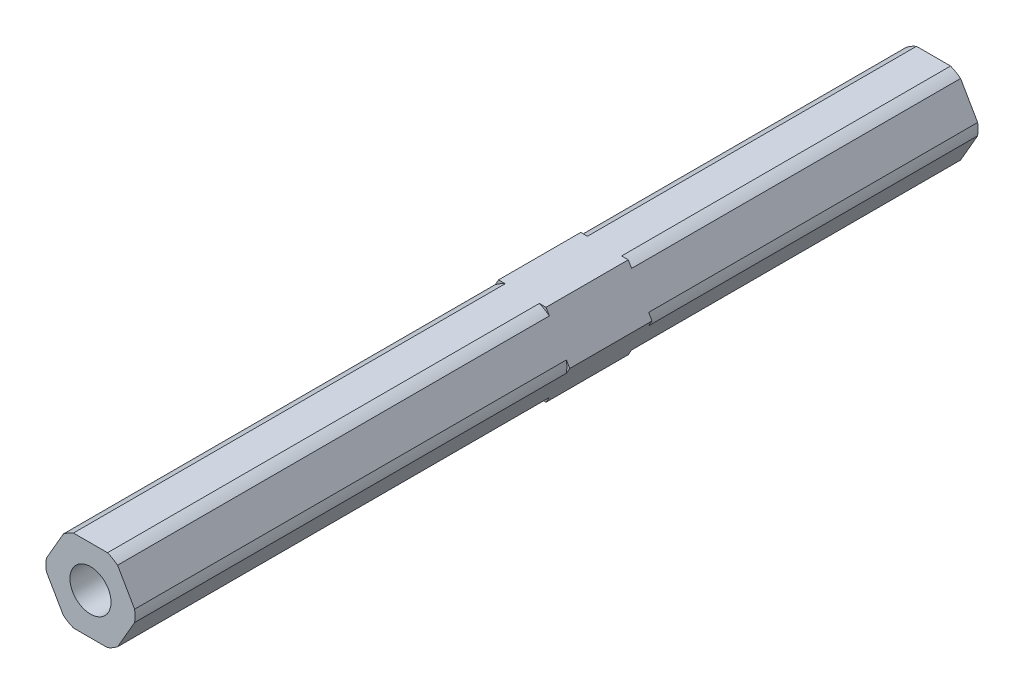
ISO-10303-21;
HEADER;
FILE_DESCRIPTION(('STEP AP214'),'2;1');
FILE_NAME('part.step','',(''),(''),'','','');
FILE_SCHEMA(('AUTOMOTIVE_DESIGN { 1 0 10303 214 1 1 1 1 }'));
ENDSEC;
DATA;
#1=APPLICATION_CONTEXT('core data for automotive mechanical design processes');
#2=APPLICATION_PROTOCOL_DEFINITION('international standard','automotive_design',2000,#1);
#3=PRODUCT_CONTEXT('',#1,'mechanical');
#4=PRODUCT('Part','Part','',(#3));
#5=PRODUCT_RELATED_PRODUCT_CATEGORY('part','',(#4));
#6=PRODUCT_DEFINITION_FORMATION('','',#4);
#7=PRODUCT_DEFINITION_CONTEXT('part definition',#1,'design');
#8=PRODUCT_DEFINITION('design','',#6,#7);
#9=PRODUCT_DEFINITION_SHAPE('','',#8);
#10=(LENGTH_UNIT() NAMED_UNIT(*) SI_UNIT(.MILLI.,.METRE.));
#11=(NAMED_UNIT(*) PLANE_ANGLE_UNIT() SI_UNIT($,.RADIAN.));
#12=(NAMED_UNIT(*) SI_UNIT($,.STERADIAN.) SOLID_ANGLE_UNIT());
#13=UNCERTAINTY_MEASURE_WITH_UNIT(LENGTH_MEASURE(1.E-05),#10,'distance_accuracy_value','');
#14=(GEOMETRIC_REPRESENTATION_CONTEXT(3) GLOBAL_UNCERTAINTY_ASSIGNED_CONTEXT((#13)) GLOBAL_UNIT_ASSIGNED_CONTEXT((#10,
#11,#12)) REPRESENTATION_CONTEXT('',''));
#15=CARTESIAN_POINT('',(0.,0.,0.));
#16=DIRECTION('',(0.,0.,1.));
#17=DIRECTION('',(1.,0.,0.));
#18=AXIS2_PLACEMENT_3D('',#15,#16,#17);
#19=CARTESIAN_POINT('',(0.,0.,0.));
#20=DIRECTION('',(0.,0.,1.));
#21=DIRECTION('',(1.,0.,0.));
#22=AXIS2_PLACEMENT_3D('',#19,#20,#21);
#23=PLANE('',#22);
#24=CARTESIAN_POINT('',(0.,0.,0.));
#25=DIRECTION('',(0.,0.,-1.));
#26=DIRECTION('',(-1.,0.,0.));
#27=AXIS2_PLACEMENT_3D('',#24,#25,#26);
#28=CIRCLE('',#27,6.875);
#29=CARTESIAN_POINT('',(-4.18177080173138,5.45696050579321,0.));
#30=VERTEX_POINT('',#29);
#31=CARTESIAN_POINT('',(-2.63498102459961,6.35,0.));
#32=VERTEX_POINT('',#31);
#33=EDGE_CURVE('E248',#30,#32,#28,.T.);
#34=ORIENTED_EDGE('',*,*,#33,.F.);
#35=DIRECTION('',(-0.5,-0.866025403784439,0.));
#36=VECTOR('',#35,1.);
#37=CARTESIAN_POINT('',(-3.66617420935412,6.35,0.));
#38=LINE('',#37,#36);
#39=CARTESIAN_POINT('',(-3.66617420935412,6.35,0.));
#40=VERTEX_POINT('',#39);
#41=EDGE_CURVE('E440',#40,#30,#38,.T.);
#42=ORIENTED_EDGE('',*,*,#41,.F.);
#43=DIRECTION('',(-1.,0.,0.));
#44=VECTOR('',#43,1.);
#45=CARTESIAN_POINT('',(3.66617420935412,6.35,0.));
#46=LINE('',#45,#44);
#47=EDGE_CURVE('E436',#32,#40,#46,.T.);
#48=ORIENTED_EDGE('',*,*,#47,.F.);
#49=EDGE_LOOP('',(#34,#42,#48));
#50=FACE_BOUND('',#49,.T.);
#51=ADVANCED_FACE('F35',(#50),#23,.F.);
#52=CARTESIAN_POINT('',(0.,0.,0.));
#53=DIRECTION('',(0.,0.,-1.));
#54=DIRECTION('',(-1.,0.,0.));
#55=AXIS2_PLACEMENT_3D('',#52,#53,#54);
#56=CIRCLE('',#55,6.875);
#57=CARTESIAN_POINT('',(-6.81675182633099,-0.89303949420679,0.));
#58=VERTEX_POINT('',#57);
#59=CARTESIAN_POINT('',(-6.81675182633099,0.893039494206787,0.));
#60=VERTEX_POINT('',#59);
#61=EDGE_CURVE('E290',#58,#60,#56,.T.);
#62=ORIENTED_EDGE('',*,*,#61,.F.);
#63=DIRECTION('',(0.5,-0.866025403784439,0.));
#64=VECTOR('',#63,1.);
#65=CARTESIAN_POINT('',(-7.33234841870825,0.,0.));
#66=LINE('',#65,#64);
#67=CARTESIAN_POINT('',(-7.33234841870825,0.,0.));
#68=VERTEX_POINT('',#67);
#69=EDGE_CURVE('E444',#68,#58,#66,.T.);
#70=ORIENTED_EDGE('',*,*,#69,.F.);
#71=EDGE_CURVE('E439',#60,#68,#38,.T.);
#72=ORIENTED_EDGE('',*,*,#71,.F.);
#73=EDGE_LOOP('',(#62,#70,#72));
#74=FACE_BOUND('',#73,.T.);
#75=ADVANCED_FACE('F565',(#74),#23,.F.);
#76=CARTESIAN_POINT('',(0.,0.,0.));
#77=DIRECTION('',(0.,0.,-1.));
#78=DIRECTION('',(-1.,0.,0.));
#79=AXIS2_PLACEMENT_3D('',#76,#77,#78);
#80=CIRCLE('',#79,6.875);
#81=CARTESIAN_POINT('',(-2.63498102459961,-6.35,0.));
#82=VERTEX_POINT('',#81);
#83=CARTESIAN_POINT('',(-4.18177080173138,-5.45696050579321,0.));
#84=VERTEX_POINT('',#83);
#85=EDGE_CURVE('E294',#82,#84,#80,.T.);
#86=ORIENTED_EDGE('',*,*,#85,.F.);
#87=DIRECTION('',(1.,0.,0.));
#88=VECTOR('',#87,1.);
#89=CARTESIAN_POINT('',(-3.66617420935412,-6.35,0.));
#90=LINE('',#89,#88);
#91=CARTESIAN_POINT('',(-3.66617420935412,-6.35,0.));
#92=VERTEX_POINT('',#91);
#93=EDGE_CURVE('E427',#92,#82,#90,.T.);
#94=ORIENTED_EDGE('',*,*,#93,.F.);
#95=EDGE_CURVE('E443',#84,#92,#66,.T.);
#96=ORIENTED_EDGE('',*,*,#95,.F.);
#97=EDGE_LOOP('',(#86,#94,#96));
#98=FACE_BOUND('',#97,.T.);
#99=ADVANCED_FACE('F562',(#98),#23,.F.);
#100=CARTESIAN_POINT('',(0.,0.,0.));
#101=DIRECTION('',(0.,0.,-1.));
#102=DIRECTION('',(-1.,0.,0.));
#103=AXIS2_PLACEMENT_3D('',#100,#101,#102);
#104=CIRCLE('',#103,6.875);
#105=CARTESIAN_POINT('',(4.18177080173138,-5.45696050579321,0.));
#106=VERTEX_POINT('',#105);
#107=CARTESIAN_POINT('',(2.63498102459961,-6.35,0.));
#108=VERTEX_POINT('',#107);
#109=EDGE_CURVE('E58',#106,#108,#104,.T.);
#110=ORIENTED_EDGE('',*,*,#109,.F.);
#111=DIRECTION('',(0.5,0.866025403784439,0.));
#112=VECTOR('',#111,1.);
#113=CARTESIAN_POINT('',(3.66617420935412,-6.35,0.));
#114=LINE('',#113,#112);
#115=CARTESIAN_POINT('',(3.66617420935412,-6.35,0.));
#116=VERTEX_POINT('',#115);
#117=EDGE_CURVE('E430',#116,#106,#114,.T.);
#118=ORIENTED_EDGE('',*,*,#117,.F.);
#119=EDGE_CURVE('E407',#108,#116,#90,.T.);
#120=ORIENTED_EDGE('',*,*,#119,.F.);
#121=EDGE_LOOP('',(#110,#118,#120));
#122=FACE_BOUND('',#121,.T.);
#123=ADVANCED_FACE('F564',(#122),#23,.F.);
#124=CARTESIAN_POINT('',(0.,0.,0.));
#125=DIRECTION('',(0.,0.,-1.));
#126=DIRECTION('',(-1.,0.,0.));
#127=AXIS2_PLACEMENT_3D('',#124,#125,#126);
#128=CIRCLE('',#127,6.875);
#129=CARTESIAN_POINT('',(6.81675182633099,0.893039494206791,0.));
#130=VERTEX_POINT('',#129);
#131=CARTESIAN_POINT('',(6.81675182633099,-0.893039494206787,0.));
#132=VERTEX_POINT('',#131);
#133=EDGE_CURVE('E261',#130,#132,#128,.T.);
#134=ORIENTED_EDGE('',*,*,#133,.F.);
#135=DIRECTION('',(-0.5,0.866025403784439,0.));
#136=VECTOR('',#135,1.);
#137=CARTESIAN_POINT('',(7.33234841870825,0.,0.));
#138=LINE('',#137,#136);
#139=CARTESIAN_POINT('',(7.33234841870825,0.,0.));
#140=VERTEX_POINT('',#139);
#141=EDGE_CURVE('E433',#140,#130,#138,.T.);
#142=ORIENTED_EDGE('',*,*,#141,.F.);
#143=EDGE_CURVE('E50',#132,#140,#114,.T.);
#144=ORIENTED_EDGE('',*,*,#143,.F.);
#145=EDGE_LOOP('',(#134,#142,#144));
#146=FACE_BOUND('',#145,.T.);
#147=ADVANCED_FACE('F464',(#146),#23,.F.);
#148=CARTESIAN_POINT('',(0.,0.,12.7));
#149=DIRECTION('',(0.,0.,1.));
#150=DIRECTION('',(1.,0.,0.));
#151=AXIS2_PLACEMENT_3D('',#148,#149,#150);
#152=PLANE('',#151);
#153=CARTESIAN_POINT('',(0.,0.,12.7));
#154=DIRECTION('',(0.,0.,1.));
#155=DIRECTION('',(1.,0.,0.));
#156=AXIS2_PLACEMENT_3D('',#153,#154,#155);
#157=CIRCLE('',#156,6.875);
#158=CARTESIAN_POINT('',(-2.63498102459961,6.35,12.7));
#159=VERTEX_POINT('',#158);
#160=CARTESIAN_POINT('',(-4.18177080173138,5.45696050579321,12.7));
#161=VERTEX_POINT('',#160);
#162=EDGE_CURVE('E301',#159,#161,#157,.T.);
#163=ORIENTED_EDGE('',*,*,#162,.F.);
#164=DIRECTION('',(-1.,0.,0.));
#165=VECTOR('',#164,1.);
#166=CARTESIAN_POINT('',(3.66617420935412,6.35,12.7));
#167=LINE('',#166,#165);
#168=CARTESIAN_POINT('',(-3.66617420935412,6.35,12.7));
#169=VERTEX_POINT('',#168);
#170=EDGE_CURVE('E417',#159,#169,#167,.T.);
#171=ORIENTED_EDGE('',*,*,#170,.T.);
#172=DIRECTION('',(-0.5,-0.866025403784439,0.));
#173=VECTOR('',#172,1.);
#174=CARTESIAN_POINT('',(-3.66617420935412,6.35,12.7));
#175=LINE('',#174,#173);
#176=EDGE_CURVE('E421',#169,#161,#175,.T.);
#177=ORIENTED_EDGE('',*,*,#176,.T.);
#178=EDGE_LOOP('',(#163,#171,#177));
#179=FACE_BOUND('',#178,.T.);
#180=ADVANCED_FACE('F538',(#179),#152,.T.);
#181=CARTESIAN_POINT('',(0.,0.,12.7));
#182=DIRECTION('',(0.,0.,1.));
#183=DIRECTION('',(1.,0.,0.));
#184=AXIS2_PLACEMENT_3D('',#181,#182,#183);
#185=CIRCLE('',#184,6.875);
#186=CARTESIAN_POINT('',(4.18177080173138,5.45696050579321,12.7));
#187=VERTEX_POINT('',#186);
#188=CARTESIAN_POINT('',(2.63498102459961,6.35,12.7));
#189=VERTEX_POINT('',#188);
#190=EDGE_CURVE('E333',#187,#189,#185,.T.);
#191=ORIENTED_EDGE('',*,*,#190,.F.);
#192=DIRECTION('',(-0.5,0.866025403784439,0.));
#193=VECTOR('',#192,1.);
#194=CARTESIAN_POINT('',(7.33234841870825,0.,12.7));
#195=LINE('',#194,#193);
#196=CARTESIAN_POINT('',(3.66617420935412,6.35,12.7));
#197=VERTEX_POINT('',#196);
#198=EDGE_CURVE('E414',#187,#197,#195,.T.);
#199=ORIENTED_EDGE('',*,*,#198,.T.);
#200=EDGE_CURVE('E418',#197,#189,#167,.T.);
#201=ORIENTED_EDGE('',*,*,#200,.T.);
#202=EDGE_LOOP('',(#191,#199,#201));
#203=FACE_BOUND('',#202,.T.);
#204=ADVANCED_FACE('F589',(#203),#152,.T.);
#205=CARTESIAN_POINT('',(0.,0.,12.7));
#206=DIRECTION('',(0.,0.,1.));
#207=DIRECTION('',(1.,0.,0.));
#208=AXIS2_PLACEMENT_3D('',#205,#206,#207);
#209=CIRCLE('',#208,6.875);
#210=CARTESIAN_POINT('',(6.81675182633099,-0.893039494206791,12.7));
#211=VERTEX_POINT('',#210);
#212=CARTESIAN_POINT('',(6.81675182633099,0.893039494206794,12.7));
#213=VERTEX_POINT('',#212);
#214=EDGE_CURVE('E367',#211,#213,#209,.T.);
#215=ORIENTED_EDGE('',*,*,#214,.F.);
#216=DIRECTION('',(0.5,0.866025403784439,0.));
#217=VECTOR('',#216,1.);
#218=CARTESIAN_POINT('',(3.66617420935412,-6.35,12.7));
#219=LINE('',#218,#217);
#220=CARTESIAN_POINT('',(7.33234841870825,0.,12.7));
#221=VERTEX_POINT('',#220);
#222=EDGE_CURVE('E410',#211,#221,#219,.T.);
#223=ORIENTED_EDGE('',*,*,#222,.T.);
#224=EDGE_CURVE('E415',#221,#213,#195,.T.);
#225=ORIENTED_EDGE('',*,*,#224,.T.);
#226=EDGE_LOOP('',(#215,#223,#225));
#227=FACE_BOUND('',#226,.T.);
#228=ADVANCED_FACE('F497',(#227),#152,.T.);
#229=CARTESIAN_POINT('',(0.,0.,12.7));
#230=DIRECTION('',(0.,0.,1.));
#231=DIRECTION('',(1.,0.,0.));
#232=AXIS2_PLACEMENT_3D('',#229,#230,#231);
#233=CIRCLE('',#232,6.875);
#234=CARTESIAN_POINT('',(2.63498102459961,-6.35,12.7));
#235=VERTEX_POINT('',#234);
#236=CARTESIAN_POINT('',(4.18177080173138,-5.45696050579321,12.7));
#237=VERTEX_POINT('',#236);
#238=EDGE_CURVE('E364',#235,#237,#233,.T.);
#239=ORIENTED_EDGE('',*,*,#238,.F.);
#240=DIRECTION('',(1.,0.,0.));
#241=VECTOR('',#240,1.);
#242=CARTESIAN_POINT('',(-3.66617420935412,-6.35,12.7));
#243=LINE('',#242,#241);
#244=CARTESIAN_POINT('',(3.66617420935412,-6.35,12.7));
#245=VERTEX_POINT('',#244);
#246=EDGE_CURVE('E411',#235,#245,#243,.T.);
#247=ORIENTED_EDGE('',*,*,#246,.T.);
#248=EDGE_CURVE('E412',#245,#237,#219,.T.);
#249=ORIENTED_EDGE('',*,*,#248,.T.);
#250=EDGE_LOOP('',(#239,#247,#249));
#251=FACE_BOUND('',#250,.T.);
#252=ADVANCED_FACE('F509',(#251),#152,.T.);
#253=CARTESIAN_POINT('',(0.,0.,12.7));
#254=DIRECTION('',(0.,0.,1.));
#255=DIRECTION('',(1.,0.,0.));
#256=AXIS2_PLACEMENT_3D('',#253,#254,#255);
#257=CIRCLE('',#256,6.875);
#258=CARTESIAN_POINT('',(-4.18177080173138,-5.45696050579321,12.7));
#259=VERTEX_POINT('',#258);
#260=CARTESIAN_POINT('',(-2.6349810245996,-6.35,12.7));
#261=VERTEX_POINT('',#260);
#262=EDGE_CURVE('E361',#259,#261,#257,.T.);
#263=ORIENTED_EDGE('',*,*,#262,.F.);
#264=DIRECTION('',(0.5,-0.866025403784439,0.));
#265=VECTOR('',#264,1.);
#266=CARTESIAN_POINT('',(-7.33234841870825,0.,12.7));
#267=LINE('',#266,#265);
#268=CARTESIAN_POINT('',(-3.66617420935412,-6.35,12.7));
#269=VERTEX_POINT('',#268);
#270=EDGE_CURVE('E423',#259,#269,#267,.T.);
#271=ORIENTED_EDGE('',*,*,#270,.T.);
#272=EDGE_CURVE('E408',#269,#261,#243,.T.);
#273=ORIENTED_EDGE('',*,*,#272,.T.);
#274=EDGE_LOOP('',(#263,#271,#273));
#275=FACE_BOUND('',#274,.T.);
#276=ADVANCED_FACE('F560',(#275),#152,.T.);
#277=CARTESIAN_POINT('',(-3.66617420935412,-6.35,12.7));
#278=DIRECTION('',(0.,1.,0.));
#279=DIRECTION('',(-1.,0.,0.));
#280=AXIS2_PLACEMENT_3D('',#277,#278,#279);
#281=PLANE('',#280);
#282=ORIENTED_EDGE('',*,*,#93,.T.);
#283=DIRECTION('',(0.,0.,1.));
#284=VECTOR('',#283,1.);
#285=CARTESIAN_POINT('',(-2.63498102459961,-6.35,-50.8));
#286=LINE('',#285,#284);
#287=CARTESIAN_POINT('',(-2.63498102459961,-6.35,-50.8));
#288=VERTEX_POINT('',#287);
#289=EDGE_CURVE('E316',#288,#82,#286,.T.);
#290=ORIENTED_EDGE('',*,*,#289,.F.);
#291=DIRECTION('',(1.,0.,0.));
#292=VECTOR('',#291,1.);
#293=CARTESIAN_POINT('',(-2.63498102459961,-6.35,-50.8));
#294=LINE('',#293,#292);
#295=CARTESIAN_POINT('',(2.63498102459962,-6.35,-50.8));
#296=VERTEX_POINT('',#295);
#297=EDGE_CURVE('E275',#288,#296,#294,.T.);
#298=ORIENTED_EDGE('',*,*,#297,.T.);
#299=DIRECTION('',(0.,0.,1.));
#300=VECTOR('',#299,1.);
#301=CARTESIAN_POINT('',(2.63498102459962,-6.35,-50.8));
#302=LINE('',#301,#300);
#303=EDGE_CURVE('E313',#296,#108,#302,.T.);
#304=ORIENTED_EDGE('',*,*,#303,.T.);
#305=ORIENTED_EDGE('',*,*,#119,.T.);
#306=DIRECTION('',(0.,0.,-1.));
#307=VECTOR('',#306,1.);
#308=CARTESIAN_POINT('',(3.66617420935412,-6.35,12.7));
#309=LINE('',#308,#307);
#310=EDGE_CURVE('E11',#245,#116,#309,.T.);
#311=ORIENTED_EDGE('',*,*,#310,.F.);
#312=ORIENTED_EDGE('',*,*,#246,.F.);
#313=DIRECTION('',(0.,0.,-1.));
#314=VECTOR('',#313,1.);
#315=CARTESIAN_POINT('',(2.63498102459961,-6.35,79.375));
#316=LINE('',#315,#314);
#317=CARTESIAN_POINT('',(2.63498102459961,-6.35,79.375));
#318=VERTEX_POINT('',#317);
#319=EDGE_CURVE('E389',#318,#235,#316,.T.);
#320=ORIENTED_EDGE('',*,*,#319,.F.);
#321=DIRECTION('',(1.,0.,0.));
#322=VECTOR('',#321,1.);
#323=CARTESIAN_POINT('',(-2.6349810245996,-6.35,79.375));
#324=LINE('',#323,#322);
#325=CARTESIAN_POINT('',(-2.6349810245996,-6.35,79.375));
#326=VERTEX_POINT('',#325);
#327=EDGE_CURVE('E341',#326,#318,#324,.T.);
#328=ORIENTED_EDGE('',*,*,#327,.F.);
#329=DIRECTION('',(0.,0.,-1.));
#330=VECTOR('',#329,1.);
#331=CARTESIAN_POINT('',(-2.6349810245996,-6.35,79.375));
#332=LINE('',#331,#330);
#333=EDGE_CURVE('E392',#326,#261,#332,.T.);
#334=ORIENTED_EDGE('',*,*,#333,.T.);
#335=ORIENTED_EDGE('',*,*,#272,.F.);
#336=DIRECTION('',(0.,0.,-1.));
#337=VECTOR('',#336,1.);
#338=CARTESIAN_POINT('',(-3.66617420935412,-6.35,12.7));
#339=LINE('',#338,#337);
#340=EDGE_CURVE('E426',#269,#92,#339,.T.);
#341=ORIENTED_EDGE('',*,*,#340,.T.);
#342=EDGE_LOOP('',(#282,#290,#298,#304,#305,#311,#312,#320,#328,#334,#335,#341));
#343=FACE_BOUND('',#342,.T.);
#344=ADVANCED_FACE('F37',(#343),#281,.F.);
#345=CARTESIAN_POINT('',(3.66617420935412,-6.35,12.7));
#346=DIRECTION('',(-0.866025403784439,0.5,0.));
#347=DIRECTION('',(-0.5,-0.866025403784439,0.));
#348=AXIS2_PLACEMENT_3D('',#345,#346,#347);
#349=PLANE('',#348);
#350=ORIENTED_EDGE('',*,*,#117,.T.);
#351=DIRECTION('',(0.,0.,1.));
#352=VECTOR('',#351,1.);
#353=CARTESIAN_POINT('',(4.18177080173138,-5.45696050579321,-50.8));
#354=LINE('',#353,#352);
#355=CARTESIAN_POINT('',(4.18177080173138,-5.45696050579321,-50.8));
#356=VERTEX_POINT('',#355);
#357=EDGE_CURVE('E310',#356,#106,#354,.T.);
#358=ORIENTED_EDGE('',*,*,#357,.F.);
#359=DIRECTION('',(0.5,0.866025403784439,0.));
#360=VECTOR('',#359,1.);
#361=CARTESIAN_POINT('',(4.18177080173138,-5.45696050579321,-50.8));
#362=LINE('',#361,#360);
#363=CARTESIAN_POINT('',(6.81675182633099,-0.893039494206785,-50.8));
#364=VERTEX_POINT('',#363);
#365=EDGE_CURVE('E280',#356,#364,#362,.T.);
#366=ORIENTED_EDGE('',*,*,#365,.T.);
#367=DIRECTION('',(0.,0.,1.));
#368=VECTOR('',#367,1.);
#369=CARTESIAN_POINT('',(6.81675182633099,-0.893039494206785,-50.8));
#370=LINE('',#369,#368);
#371=EDGE_CURVE('E308',#364,#132,#370,.T.);
#372=ORIENTED_EDGE('',*,*,#371,.T.);
#373=ORIENTED_EDGE('',*,*,#143,.T.);
#374=DIRECTION('',(0.,0.,-1.));
#375=VECTOR('',#374,1.);
#376=CARTESIAN_POINT('',(7.33234841870825,0.,12.7));
#377=LINE('',#376,#375);
#378=EDGE_CURVE('E43',#221,#140,#377,.T.);
#379=ORIENTED_EDGE('',*,*,#378,.F.);
#380=ORIENTED_EDGE('',*,*,#222,.F.);
#381=DIRECTION('',(0.,0.,-1.));
#382=VECTOR('',#381,1.);
#383=CARTESIAN_POINT('',(6.81675182633099,-0.893039494206794,79.375));
#384=LINE('',#383,#382);
#385=CARTESIAN_POINT('',(6.81675182633099,-0.893039494206794,79.375));
#386=VERTEX_POINT('',#385);
#387=EDGE_CURVE('E383',#386,#211,#384,.T.);
#388=ORIENTED_EDGE('',*,*,#387,.F.);
#389=DIRECTION('',(0.5,0.866025403784438,0.));
#390=VECTOR('',#389,1.);
#391=CARTESIAN_POINT('',(4.18177080173138,-5.45696050579321,79.375));
#392=LINE('',#391,#390);
#393=CARTESIAN_POINT('',(4.18177080173138,-5.45696050579321,79.375));
#394=VERTEX_POINT('',#393);
#395=EDGE_CURVE('E345',#394,#386,#392,.T.);
#396=ORIENTED_EDGE('',*,*,#395,.F.);
#397=DIRECTION('',(0.,0.,-1.));
#398=VECTOR('',#397,1.);
#399=CARTESIAN_POINT('',(4.18177080173138,-5.45696050579321,79.375));
#400=LINE('',#399,#398);
#401=EDGE_CURVE('E386',#394,#237,#400,.T.);
#402=ORIENTED_EDGE('',*,*,#401,.T.);
#403=ORIENTED_EDGE('',*,*,#248,.F.);
#404=ORIENTED_EDGE('',*,*,#310,.T.);
#405=EDGE_LOOP('',(#350,#358,#366,#372,#373,#379,#380,#388,#396,#402,#403,#404));
#406=FACE_BOUND('',#405,.T.);
#407=ADVANCED_FACE('F498',(#406),#349,.F.);
#408=CARTESIAN_POINT('',(7.33234841870825,0.,12.7));
#409=DIRECTION('',(-0.866025403784439,-0.5,0.));
#410=DIRECTION('',(0.5,-0.866025403784439,0.));
#411=AXIS2_PLACEMENT_3D('',#408,#409,#410);
#412=PLANE('',#411);
#413=ORIENTED_EDGE('',*,*,#141,.T.);
#414=DIRECTION('',(0.,0.,1.));
#415=VECTOR('',#414,1.);
#416=CARTESIAN_POINT('',(6.81675182633099,0.893039494206793,-50.8));
#417=LINE('',#416,#415);
#418=CARTESIAN_POINT('',(6.81675182633099,0.893039494206793,-50.8));
#419=VERTEX_POINT('',#418);
#420=EDGE_CURVE('E305',#419,#130,#417,.T.);
#421=ORIENTED_EDGE('',*,*,#420,.F.);
#422=DIRECTION('',(-0.5,0.866025403784439,0.));
#423=VECTOR('',#422,1.);
#424=CARTESIAN_POINT('',(6.81675182633099,0.893039494206793,-50.8));
#425=LINE('',#424,#423);
#426=CARTESIAN_POINT('',(4.18177080173138,5.45696050579321,-50.8));
#427=VERTEX_POINT('',#426);
#428=EDGE_CURVE('E285',#419,#427,#425,.T.);
#429=ORIENTED_EDGE('',*,*,#428,.T.);
#430=DIRECTION('',(0.,0.,1.));
#431=VECTOR('',#430,1.);
#432=CARTESIAN_POINT('',(4.18177080173138,5.45696050579321,-50.8));
#433=LINE('',#432,#431);
#434=CARTESIAN_POINT('',(4.18177080173138,5.45696050579321,0.));
#435=VERTEX_POINT('',#434);
#436=EDGE_CURVE('E302',#427,#435,#433,.T.);
#437=ORIENTED_EDGE('',*,*,#436,.T.);
#438=CARTESIAN_POINT('',(3.66617420935412,6.35,0.));
#439=VERTEX_POINT('',#438);
#440=EDGE_CURVE('E432',#435,#439,#138,.T.);
#441=ORIENTED_EDGE('',*,*,#440,.T.);
#442=DIRECTION('',(0.,0.,-1.));
#443=VECTOR('',#442,1.);
#444=CARTESIAN_POINT('',(3.66617420935412,6.35,12.7));
#445=LINE('',#444,#443);
#446=EDGE_CURVE('E455',#197,#439,#445,.T.);
#447=ORIENTED_EDGE('',*,*,#446,.F.);
#448=ORIENTED_EDGE('',*,*,#198,.F.);
#449=DIRECTION('',(0.,0.,-1.));
#450=VECTOR('',#449,1.);
#451=CARTESIAN_POINT('',(4.18177080173138,5.45696050579321,79.375));
#452=LINE('',#451,#450);
#453=CARTESIAN_POINT('',(4.18177080173138,5.45696050579321,79.375));
#454=VERTEX_POINT('',#453);
#455=EDGE_CURVE('E377',#454,#187,#452,.T.);
#456=ORIENTED_EDGE('',*,*,#455,.F.);
#457=DIRECTION('',(-0.5,0.866025403784439,0.));
#458=VECTOR('',#457,1.);
#459=CARTESIAN_POINT('',(6.81675182633099,0.893039494206794,79.375));
#460=LINE('',#459,#458);
#461=CARTESIAN_POINT('',(6.81675182633099,0.893039494206794,79.375));
#462=VERTEX_POINT('',#461);
#463=EDGE_CURVE('E349',#462,#454,#460,.T.);
#464=ORIENTED_EDGE('',*,*,#463,.F.);
#465=DIRECTION('',(0.,0.,-1.));
#466=VECTOR('',#465,1.);
#467=CARTESIAN_POINT('',(6.81675182633099,0.893039494206794,79.375));
#468=LINE('',#467,#466);
#469=EDGE_CURVE('E380',#462,#213,#468,.T.);
#470=ORIENTED_EDGE('',*,*,#469,.T.);
#471=ORIENTED_EDGE('',*,*,#224,.F.);
#472=ORIENTED_EDGE('',*,*,#378,.T.);
#473=EDGE_LOOP('',(#413,#421,#429,#437,#441,#447,#448,#456,#464,#470,#471,#472));
#474=FACE_BOUND('',#473,.T.);
#475=ADVANCED_FACE('F461',(#474),#412,.F.);
#476=CARTESIAN_POINT('',(3.66617420935412,6.35,12.7));
#477=DIRECTION('',(0.,-1.,0.));
#478=DIRECTION('',(1.,0.,0.));
#479=AXIS2_PLACEMENT_3D('',#476,#477,#478);
#480=PLANE('',#479);
#481=CARTESIAN_POINT('',(2.63498102459961,6.35,0.));
#482=VERTEX_POINT('',#481);
#483=EDGE_CURVE('E437',#439,#482,#46,.T.);
#484=ORIENTED_EDGE('',*,*,#483,.T.);
#485=DIRECTION('',(0.,0.,1.));
#486=VECTOR('',#485,1.);
#487=CARTESIAN_POINT('',(2.63498102459961,6.35,-50.8));
#488=LINE('',#487,#486);
#489=CARTESIAN_POINT('',(2.63498102459961,6.35,-50.8));
#490=VERTEX_POINT('',#489);
#491=EDGE_CURVE('E256',#490,#482,#488,.T.);
#492=ORIENTED_EDGE('',*,*,#491,.F.);
#493=DIRECTION('',(-1.,0.,0.));
#494=VECTOR('',#493,1.);
#495=CARTESIAN_POINT('',(2.63498102459961,6.35,-50.8));
#496=LINE('',#495,#494);
#497=CARTESIAN_POINT('',(-2.63498102459961,6.35,-50.8));
#498=VERTEX_POINT('',#497);
#499=EDGE_CURVE('E238',#490,#498,#496,.T.);
#500=ORIENTED_EDGE('',*,*,#499,.T.);
#501=DIRECTION('',(0.,0.,1.));
#502=VECTOR('',#501,1.);
#503=CARTESIAN_POINT('',(-2.63498102459961,6.35,-50.8));
#504=LINE('',#503,#502);
#505=EDGE_CURVE('E246',#498,#32,#504,.T.);
#506=ORIENTED_EDGE('',*,*,#505,.T.);
#507=ORIENTED_EDGE('',*,*,#47,.T.);
#508=DIRECTION('',(0.,0.,-1.));
#509=VECTOR('',#508,1.);
#510=CARTESIAN_POINT('',(-3.66617420935412,6.35,12.7));
#511=LINE('',#510,#509);
#512=EDGE_CURVE('E452',#169,#40,#511,.T.);
#513=ORIENTED_EDGE('',*,*,#512,.F.);
#514=ORIENTED_EDGE('',*,*,#170,.F.);
#515=DIRECTION('',(0.,0.,-1.));
#516=VECTOR('',#515,1.);
#517=CARTESIAN_POINT('',(-2.63498102459961,6.35,79.375));
#518=LINE('',#517,#516);
#519=CARTESIAN_POINT('',(-2.63498102459961,6.35,79.375));
#520=VERTEX_POINT('',#519);
#521=EDGE_CURVE('E355',#520,#159,#518,.T.);
#522=ORIENTED_EDGE('',*,*,#521,.F.);
#523=DIRECTION('',(-1.,0.,0.));
#524=VECTOR('',#523,1.);
#525=CARTESIAN_POINT('',(2.63498102459961,6.35,79.375));
#526=LINE('',#525,#524);
#527=CARTESIAN_POINT('',(2.63498102459961,6.35,79.375));
#528=VERTEX_POINT('',#527);
#529=EDGE_CURVE('E353',#528,#520,#526,.T.);
#530=ORIENTED_EDGE('',*,*,#529,.F.);
#531=DIRECTION('',(0.,0.,-1.));
#532=VECTOR('',#531,1.);
#533=CARTESIAN_POINT('',(2.63498102459961,6.35,79.375));
#534=LINE('',#533,#532);
#535=EDGE_CURVE('E374',#528,#189,#534,.T.);
#536=ORIENTED_EDGE('',*,*,#535,.T.);
#537=ORIENTED_EDGE('',*,*,#200,.F.);
#538=ORIENTED_EDGE('',*,*,#446,.T.);
#539=EDGE_LOOP('',(#484,#492,#500,#506,#507,#513,#514,#522,#530,#536,#537,#538));
#540=FACE_BOUND('',#539,.T.);
#541=ADVANCED_FACE('F254',(#540),#480,.F.);
#542=CARTESIAN_POINT('',(-3.66617420935412,6.35,12.7));
#543=DIRECTION('',(0.866025403784439,-0.5,0.));
#544=DIRECTION('',(0.5,0.866025403784439,0.));
#545=AXIS2_PLACEMENT_3D('',#542,#543,#544);
#546=PLANE('',#545);
#547=ORIENTED_EDGE('',*,*,#41,.T.);
#548=DIRECTION('',(0.,0.,1.));
#549=VECTOR('',#548,1.);
#550=CARTESIAN_POINT('',(-4.18177080173138,5.45696050579321,-50.8));
#551=LINE('',#550,#549);
#552=CARTESIAN_POINT('',(-4.18177080173138,5.45696050579321,-50.8));
#553=VERTEX_POINT('',#552);
#554=EDGE_CURVE('E250',#553,#30,#551,.T.);
#555=ORIENTED_EDGE('',*,*,#554,.F.);
#556=DIRECTION('',(-0.5,-0.866025403784439,0.));
#557=VECTOR('',#556,1.);
#558=CARTESIAN_POINT('',(-4.18177080173138,5.45696050579321,-50.8));
#559=LINE('',#558,#557);
#560=CARTESIAN_POINT('',(-6.81675182633099,0.89303949420678,-50.8));
#561=VERTEX_POINT('',#560);
#562=EDGE_CURVE('E240',#553,#561,#559,.T.);
#563=ORIENTED_EDGE('',*,*,#562,.T.);
#564=DIRECTION('',(0.,0.,1.));
#565=VECTOR('',#564,1.);
#566=CARTESIAN_POINT('',(-6.81675182633099,0.89303949420678,-50.8));
#567=LINE('',#566,#565);
#568=EDGE_CURVE('E325',#561,#60,#567,.T.);
#569=ORIENTED_EDGE('',*,*,#568,.T.);
#570=ORIENTED_EDGE('',*,*,#71,.T.);
#571=DIRECTION('',(0.,0.,-1.));
#572=VECTOR('',#571,1.);
#573=CARTESIAN_POINT('',(-7.33234841870825,0.,12.7));
#574=LINE('',#573,#572);
#575=CARTESIAN_POINT('',(-7.33234841870825,0.,12.7));
#576=VERTEX_POINT('',#575);
#577=EDGE_CURVE('E449',#576,#68,#574,.T.);
#578=ORIENTED_EDGE('',*,*,#577,.F.);
#579=CARTESIAN_POINT('',(-6.81675182633099,0.893039494206788,12.7));
#580=VERTEX_POINT('',#579);
#581=EDGE_CURVE('E420',#580,#576,#175,.T.);
#582=ORIENTED_EDGE('',*,*,#581,.F.);
#583=DIRECTION('',(0.,0.,-1.));
#584=VECTOR('',#583,1.);
#585=CARTESIAN_POINT('',(-6.81675182633099,0.893039494206787,79.375));
#586=LINE('',#585,#584);
#587=CARTESIAN_POINT('',(-6.81675182633099,0.893039494206787,79.375));
#588=VERTEX_POINT('',#587);
#589=EDGE_CURVE('E401',#588,#580,#586,.T.);
#590=ORIENTED_EDGE('',*,*,#589,.F.);
#591=DIRECTION('',(-0.5,-0.866025403784439,0.));
#592=VECTOR('',#591,1.);
#593=CARTESIAN_POINT('',(-4.18177080173138,5.45696050579321,79.375));
#594=LINE('',#593,#592);
#595=CARTESIAN_POINT('',(-4.18177080173138,5.45696050579321,79.375));
#596=VERTEX_POINT('',#595);
#597=EDGE_CURVE('E332',#596,#588,#594,.T.);
#598=ORIENTED_EDGE('',*,*,#597,.F.);
#599=DIRECTION('',(0.,0.,-1.));
#600=VECTOR('',#599,1.);
#601=CARTESIAN_POINT('',(-4.18177080173138,5.45696050579321,79.375));
#602=LINE('',#601,#600);
#603=EDGE_CURVE('E404',#596,#161,#602,.T.);
#604=ORIENTED_EDGE('',*,*,#603,.T.);
#605=ORIENTED_EDGE('',*,*,#176,.F.);
#606=ORIENTED_EDGE('',*,*,#512,.T.);
#607=EDGE_LOOP('',(#547,#555,#563,#569,#570,#578,#582,#590,#598,#604,#605,#606));
#608=FACE_BOUND('',#607,.T.);
#609=ADVANCED_FACE('F530',(#608),#546,.F.);
#610=CARTESIAN_POINT('',(-7.33234841870825,0.,12.7));
#611=DIRECTION('',(0.866025403784439,0.5,0.));
#612=DIRECTION('',(-0.5,0.866025403784439,0.));
#613=AXIS2_PLACEMENT_3D('',#610,#611,#612);
#614=PLANE('',#613);
#615=ORIENTED_EDGE('',*,*,#69,.T.);
#616=DIRECTION('',(0.,0.,1.));
#617=VECTOR('',#616,1.);
#618=CARTESIAN_POINT('',(-6.81675182633099,-0.893039494206788,-50.8));
#619=LINE('',#618,#617);
#620=CARTESIAN_POINT('',(-6.81675182633099,-0.893039494206788,-50.8));
#621=VERTEX_POINT('',#620);
#622=EDGE_CURVE('E322',#621,#58,#619,.T.);
#623=ORIENTED_EDGE('',*,*,#622,.F.);
#624=DIRECTION('',(0.5,-0.866025403784439,0.));
#625=VECTOR('',#624,1.);
#626=CARTESIAN_POINT('',(-6.81675182633099,-0.893039494206788,-50.8));
#627=LINE('',#626,#625);
#628=CARTESIAN_POINT('',(-4.18177080173138,-5.45696050579321,-50.8));
#629=VERTEX_POINT('',#628);
#630=EDGE_CURVE('E270',#621,#629,#627,.T.);
#631=ORIENTED_EDGE('',*,*,#630,.T.);
#632=DIRECTION('',(0.,0.,1.));
#633=VECTOR('',#632,1.);
#634=CARTESIAN_POINT('',(-4.18177080173138,-5.45696050579321,-50.8));
#635=LINE('',#634,#633);
#636=EDGE_CURVE('E319',#629,#84,#635,.T.);
#637=ORIENTED_EDGE('',*,*,#636,.T.);
#638=ORIENTED_EDGE('',*,*,#95,.T.);
#639=ORIENTED_EDGE('',*,*,#340,.F.);
#640=ORIENTED_EDGE('',*,*,#270,.F.);
#641=DIRECTION('',(0.,0.,-1.));
#642=VECTOR('',#641,1.);
#643=CARTESIAN_POINT('',(-4.18177080173138,-5.45696050579321,79.375));
#644=LINE('',#643,#642);
#645=CARTESIAN_POINT('',(-4.18177080173138,-5.45696050579321,79.375));
#646=VERTEX_POINT('',#645);
#647=EDGE_CURVE('E395',#646,#259,#644,.T.);
#648=ORIENTED_EDGE('',*,*,#647,.F.);
#649=DIRECTION('',(0.5,-0.866025403784439,0.));
#650=VECTOR('',#649,1.);
#651=CARTESIAN_POINT('',(-6.81675182633099,-0.89303949420679,79.375));
#652=LINE('',#651,#650);
#653=CARTESIAN_POINT('',(-6.81675182633099,-0.89303949420679,79.375));
#654=VERTEX_POINT('',#653);
#655=EDGE_CURVE('E337',#654,#646,#652,.T.);
#656=ORIENTED_EDGE('',*,*,#655,.F.);
#657=DIRECTION('',(0.,0.,-1.));
#658=VECTOR('',#657,1.);
#659=CARTESIAN_POINT('',(-6.81675182633099,-0.89303949420679,79.375));
#660=LINE('',#659,#658);
#661=CARTESIAN_POINT('',(-6.81675182633099,-0.89303949420679,12.7));
#662=VERTEX_POINT('',#661);
#663=EDGE_CURVE('E398',#654,#662,#660,.T.);
#664=ORIENTED_EDGE('',*,*,#663,.T.);
#665=EDGE_CURVE('E424',#576,#662,#267,.T.);
#666=ORIENTED_EDGE('',*,*,#665,.F.);
#667=ORIENTED_EDGE('',*,*,#577,.T.);
#668=EDGE_LOOP('',(#615,#623,#631,#637,#638,#639,#640,#648,#656,#664,#666,#667));
#669=FACE_BOUND('',#668,.T.);
#670=ADVANCED_FACE('F524',(#669),#614,.F.);
#671=CARTESIAN_POINT('',(0.,0.,12.7));
#672=DIRECTION('',(0.,0.,1.));
#673=DIRECTION('',(1.,0.,0.));
#674=AXIS2_PLACEMENT_3D('',#671,#672,#673);
#675=CIRCLE('',#674,6.875);
#676=EDGE_CURVE('E358',#580,#662,#675,.T.);
#677=ORIENTED_EDGE('',*,*,#676,.F.);
#678=ORIENTED_EDGE('',*,*,#581,.T.);
#679=ORIENTED_EDGE('',*,*,#665,.T.);
#680=EDGE_LOOP('',(#677,#678,#679));
#681=FACE_BOUND('',#680,.T.);
#682=ADVANCED_FACE('F578',(#681),#152,.T.);
#683=CARTESIAN_POINT('',(0.,0.,0.));
#684=DIRECTION('',(0.,0.,-1.));
#685=DIRECTION('',(-1.,0.,0.));
#686=AXIS2_PLACEMENT_3D('',#683,#684,#685);
#687=CIRCLE('',#686,6.875);
#688=EDGE_CURVE('E258',#482,#435,#687,.T.);
#689=ORIENTED_EDGE('',*,*,#688,.F.);
#690=ORIENTED_EDGE('',*,*,#483,.F.);
#691=ORIENTED_EDGE('',*,*,#440,.F.);
#692=EDGE_LOOP('',(#689,#690,#691));
#693=FACE_BOUND('',#692,.T.);
#694=ADVANCED_FACE('F476',(#693),#23,.F.);
#695=CARTESIAN_POINT('',(0.,0.,79.375));
#696=DIRECTION('',(0.,0.,-1.));
#697=DIRECTION('',(-1.,0.,0.));
#698=AXIS2_PLACEMENT_3D('',#695,#696,#697);
#699=CYLINDRICAL_SURFACE('',#698,6.875);
#700=ORIENTED_EDGE('',*,*,#162,.T.);
#701=ORIENTED_EDGE('',*,*,#603,.F.);
#702=CARTESIAN_POINT('',(0.,0.,79.375));
#703=DIRECTION('',(0.,0.,1.));
#704=DIRECTION('',(1.,0.,0.));
#705=AXIS2_PLACEMENT_3D('',#702,#703,#704);
#706=CIRCLE('',#705,6.875);
#707=EDGE_CURVE('E329',#520,#596,#706,.T.);
#708=ORIENTED_EDGE('',*,*,#707,.F.);
#709=ORIENTED_EDGE('',*,*,#521,.T.);
#710=EDGE_LOOP('',(#700,#701,#708,#709));
#711=FACE_BOUND('',#710,.T.);
#712=ADVANCED_FACE('F540',(#711),#699,.T.);
#713=CARTESIAN_POINT('',(0.,0.,79.375));
#714=DIRECTION('',(0.,0.,-1.));
#715=DIRECTION('',(-1.,0.,0.));
#716=AXIS2_PLACEMENT_3D('',#713,#714,#715);
#717=CYLINDRICAL_SURFACE('',#716,6.875);
#718=ORIENTED_EDGE('',*,*,#676,.T.);
#719=ORIENTED_EDGE('',*,*,#663,.F.);
#720=CARTESIAN_POINT('',(0.,0.,79.375));
#721=DIRECTION('',(0.,0.,1.));
#722=DIRECTION('',(1.,0.,0.));
#723=AXIS2_PLACEMENT_3D('',#720,#721,#722);
#724=CIRCLE('',#723,6.875);
#725=EDGE_CURVE('E335',#588,#654,#724,.T.);
#726=ORIENTED_EDGE('',*,*,#725,.F.);
#727=ORIENTED_EDGE('',*,*,#589,.T.);
#728=EDGE_LOOP('',(#718,#719,#726,#727));
#729=FACE_BOUND('',#728,.T.);
#730=ADVANCED_FACE('F548',(#729),#717,.T.);
#731=CARTESIAN_POINT('',(0.,0.,79.375));
#732=DIRECTION('',(0.,0.,-1.));
#733=DIRECTION('',(-1.,0.,0.));
#734=AXIS2_PLACEMENT_3D('',#731,#732,#733);
#735=CYLINDRICAL_SURFACE('',#734,6.875);
#736=ORIENTED_EDGE('',*,*,#262,.T.);
#737=ORIENTED_EDGE('',*,*,#333,.F.);
#738=CARTESIAN_POINT('',(0.,0.,79.375));
#739=DIRECTION('',(0.,0.,1.));
#740=DIRECTION('',(1.,0.,0.));
#741=AXIS2_PLACEMENT_3D('',#738,#739,#740);
#742=CIRCLE('',#741,6.875);
#743=EDGE_CURVE('E339',#646,#326,#742,.T.);
#744=ORIENTED_EDGE('',*,*,#743,.F.);
#745=ORIENTED_EDGE('',*,*,#647,.T.);
#746=EDGE_LOOP('',(#736,#737,#744,#745));
#747=FACE_BOUND('',#746,.T.);
#748=ADVANCED_FACE('F556',(#747),#735,.T.);
#749=CARTESIAN_POINT('',(0.,0.,79.375));
#750=DIRECTION('',(0.,0.,-1.));
#751=DIRECTION('',(-1.,0.,0.));
#752=AXIS2_PLACEMENT_3D('',#749,#750,#751);
#753=CYLINDRICAL_SURFACE('',#752,6.875);
#754=ORIENTED_EDGE('',*,*,#238,.T.);
#755=ORIENTED_EDGE('',*,*,#401,.F.);
#756=CARTESIAN_POINT('',(0.,0.,79.375));
#757=DIRECTION('',(0.,0.,1.));
#758=DIRECTION('',(1.,0.,0.));
#759=AXIS2_PLACEMENT_3D('',#756,#757,#758);
#760=CIRCLE('',#759,6.875);
#761=EDGE_CURVE('E343',#318,#394,#760,.T.);
#762=ORIENTED_EDGE('',*,*,#761,.F.);
#763=ORIENTED_EDGE('',*,*,#319,.T.);
#764=EDGE_LOOP('',(#754,#755,#762,#763));
#765=FACE_BOUND('',#764,.T.);
#766=ADVANCED_FACE('F506',(#765),#753,.T.);
#767=CARTESIAN_POINT('',(0.,0.,79.375));
#768=DIRECTION('',(0.,0.,-1.));
#769=DIRECTION('',(-1.,0.,0.));
#770=AXIS2_PLACEMENT_3D('',#767,#768,#769);
#771=CYLINDRICAL_SURFACE('',#770,6.875);
#772=ORIENTED_EDGE('',*,*,#214,.T.);
#773=ORIENTED_EDGE('',*,*,#469,.F.);
#774=CARTESIAN_POINT('',(0.,0.,79.375));
#775=DIRECTION('',(0.,0.,1.));
#776=DIRECTION('',(1.,0.,0.));
#777=AXIS2_PLACEMENT_3D('',#774,#775,#776);
#778=CIRCLE('',#777,6.875);
#779=EDGE_CURVE('E347',#386,#462,#778,.T.);
#780=ORIENTED_EDGE('',*,*,#779,.F.);
#781=ORIENTED_EDGE('',*,*,#387,.T.);
#782=EDGE_LOOP('',(#772,#773,#780,#781));
#783=FACE_BOUND('',#782,.T.);
#784=ADVANCED_FACE('F494',(#783),#771,.T.);
#785=CARTESIAN_POINT('',(0.,0.,79.375));
#786=DIRECTION('',(0.,0.,-1.));
#787=DIRECTION('',(-1.,0.,0.));
#788=AXIS2_PLACEMENT_3D('',#785,#786,#787);
#789=CYLINDRICAL_SURFACE('',#788,6.875);
#790=ORIENTED_EDGE('',*,*,#190,.T.);
#791=ORIENTED_EDGE('',*,*,#535,.F.);
#792=CARTESIAN_POINT('',(0.,0.,79.375));
#793=DIRECTION('',(0.,0.,1.));
#794=DIRECTION('',(1.,0.,0.));
#795=AXIS2_PLACEMENT_3D('',#792,#793,#794);
#796=CIRCLE('',#795,6.875);
#797=EDGE_CURVE('E351',#454,#528,#796,.T.);
#798=ORIENTED_EDGE('',*,*,#797,.F.);
#799=ORIENTED_EDGE('',*,*,#455,.T.);
#800=EDGE_LOOP('',(#790,#791,#798,#799));
#801=FACE_BOUND('',#800,.T.);
#802=ADVANCED_FACE('F485',(#801),#789,.T.);
#803=CARTESIAN_POINT('',(0.,0.,79.375));
#804=DIRECTION('',(0.,0.,1.));
#805=DIRECTION('',(1.,0.,0.));
#806=AXIS2_PLACEMENT_3D('',#803,#804,#805);
#807=PLANE('',#806);
#808=CARTESIAN_POINT('',(0.,0.,79.375));
#809=DIRECTION('',(0.,0.,1.));
#810=DIRECTION('',(1.,0.,0.));
#811=AXIS2_PLACEMENT_3D('',#808,#809,#810);
#812=CIRCLE('',#811,3.175);
#813=CARTESIAN_POINT('',(3.175,0.,79.375));
#814=VERTEX_POINT('',#813);
#815=EDGE_CURVE('E264',#814,#814,#812,.T.);
#816=ORIENTED_EDGE('',*,*,#815,.F.);
#817=EDGE_LOOP('',(#816));
#818=FACE_BOUND('',#817,.T.);
#819=ORIENTED_EDGE('',*,*,#707,.T.);
#820=ORIENTED_EDGE('',*,*,#597,.T.);
#821=ORIENTED_EDGE('',*,*,#725,.T.);
#822=ORIENTED_EDGE('',*,*,#655,.T.);
#823=ORIENTED_EDGE('',*,*,#743,.T.);
#824=ORIENTED_EDGE('',*,*,#327,.T.);
#825=ORIENTED_EDGE('',*,*,#761,.T.);
#826=ORIENTED_EDGE('',*,*,#395,.T.);
#827=ORIENTED_EDGE('',*,*,#779,.T.);
#828=ORIENTED_EDGE('',*,*,#463,.T.);
#829=ORIENTED_EDGE('',*,*,#797,.T.);
#830=ORIENTED_EDGE('',*,*,#529,.T.);
#831=EDGE_LOOP('',(#819,#820,#821,#822,#823,#824,#825,#826,#827,#828,#829,#830));
#832=FACE_BOUND('',#831,.T.);
#833=ADVANCED_FACE('F489',(#818,#832),#807,.T.);
#834=CARTESIAN_POINT('',(0.,0.,-50.8));
#835=DIRECTION('',(0.,0.,1.));
#836=DIRECTION('',(1.,0.,0.));
#837=AXIS2_PLACEMENT_3D('',#834,#835,#836);
#838=CYLINDRICAL_SURFACE('',#837,6.875);
#839=ORIENTED_EDGE('',*,*,#688,.T.);
#840=ORIENTED_EDGE('',*,*,#436,.F.);
#841=CARTESIAN_POINT('',(0.,0.,-50.8));
#842=DIRECTION('',(0.,0.,-1.));
#843=DIRECTION('',(-1.,0.,0.));
#844=AXIS2_PLACEMENT_3D('',#841,#842,#843);
#845=CIRCLE('',#844,6.875);
#846=EDGE_CURVE('E251',#490,#427,#845,.T.);
#847=ORIENTED_EDGE('',*,*,#846,.F.);
#848=ORIENTED_EDGE('',*,*,#491,.T.);
#849=EDGE_LOOP('',(#839,#840,#847,#848));
#850=FACE_BOUND('',#849,.T.);
#851=ADVANCED_FACE('F473',(#850),#838,.T.);
#852=CARTESIAN_POINT('',(0.,0.,-50.8));
#853=DIRECTION('',(0.,0.,1.));
#854=DIRECTION('',(1.,0.,0.));
#855=AXIS2_PLACEMENT_3D('',#852,#853,#854);
#856=CYLINDRICAL_SURFACE('',#855,6.875);
#857=ORIENTED_EDGE('',*,*,#133,.T.);
#858=ORIENTED_EDGE('',*,*,#371,.F.);
#859=CARTESIAN_POINT('',(0.,0.,-50.8));
#860=DIRECTION('',(0.,0.,-1.));
#861=DIRECTION('',(-1.,0.,0.));
#862=AXIS2_PLACEMENT_3D('',#859,#860,#861);
#863=CIRCLE('',#862,6.875);
#864=EDGE_CURVE('E283',#419,#364,#863,.T.);
#865=ORIENTED_EDGE('',*,*,#864,.F.);
#866=ORIENTED_EDGE('',*,*,#420,.T.);
#867=EDGE_LOOP('',(#857,#858,#865,#866));
#868=FACE_BOUND('',#867,.T.);
#869=ADVANCED_FACE('F467',(#868),#856,.T.);
#870=CARTESIAN_POINT('',(0.,0.,-50.8));
#871=DIRECTION('',(0.,0.,1.));
#872=DIRECTION('',(1.,0.,0.));
#873=AXIS2_PLACEMENT_3D('',#870,#871,#872);
#874=CYLINDRICAL_SURFACE('',#873,6.875);
#875=ORIENTED_EDGE('',*,*,#109,.T.);
#876=ORIENTED_EDGE('',*,*,#303,.F.);
#877=CARTESIAN_POINT('',(0.,0.,-50.8));
#878=DIRECTION('',(0.,0.,-1.));
#879=DIRECTION('',(-1.,0.,0.));
#880=AXIS2_PLACEMENT_3D('',#877,#878,#879);
#881=CIRCLE('',#880,6.875);
#882=EDGE_CURVE('E278',#356,#296,#881,.T.);
#883=ORIENTED_EDGE('',*,*,#882,.F.);
#884=ORIENTED_EDGE('',*,*,#357,.T.);
#885=EDGE_LOOP('',(#875,#876,#883,#884));
#886=FACE_BOUND('',#885,.T.);
#887=ADVANCED_FACE('F514',(#886),#874,.T.);
#888=CARTESIAN_POINT('',(0.,0.,-50.8));
#889=DIRECTION('',(0.,0.,1.));
#890=DIRECTION('',(1.,0.,0.));
#891=AXIS2_PLACEMENT_3D('',#888,#889,#890);
#892=CYLINDRICAL_SURFACE('',#891,6.875);
#893=ORIENTED_EDGE('',*,*,#85,.T.);
#894=ORIENTED_EDGE('',*,*,#636,.F.);
#895=CARTESIAN_POINT('',(0.,0.,-50.8));
#896=DIRECTION('',(0.,0.,-1.));
#897=DIRECTION('',(-1.,0.,0.));
#898=AXIS2_PLACEMENT_3D('',#895,#896,#897);
#899=CIRCLE('',#898,6.875);
#900=EDGE_CURVE('E273',#288,#629,#899,.T.);
#901=ORIENTED_EDGE('',*,*,#900,.F.);
#902=ORIENTED_EDGE('',*,*,#289,.T.);
#903=EDGE_LOOP('',(#893,#894,#901,#902));
#904=FACE_BOUND('',#903,.T.);
#905=ADVANCED_FACE('F522',(#904),#892,.T.);
#906=CARTESIAN_POINT('',(0.,0.,-50.8));
#907=DIRECTION('',(0.,0.,1.));
#908=DIRECTION('',(1.,0.,0.));
#909=AXIS2_PLACEMENT_3D('',#906,#907,#908);
#910=CYLINDRICAL_SURFACE('',#909,6.875);
#911=ORIENTED_EDGE('',*,*,#61,.T.);
#912=ORIENTED_EDGE('',*,*,#568,.F.);
#913=CARTESIAN_POINT('',(0.,0.,-50.8));
#914=DIRECTION('',(0.,0.,-1.));
#915=DIRECTION('',(-1.,0.,0.));
#916=AXIS2_PLACEMENT_3D('',#913,#914,#915);
#917=CIRCLE('',#916,6.875);
#918=EDGE_CURVE('E268',#621,#561,#917,.T.);
#919=ORIENTED_EDGE('',*,*,#918,.F.);
#920=ORIENTED_EDGE('',*,*,#622,.T.);
#921=EDGE_LOOP('',(#911,#912,#919,#920));
#922=FACE_BOUND('',#921,.T.);
#923=ADVANCED_FACE('F528',(#922),#910,.T.);
#924=CARTESIAN_POINT('',(0.,0.,-50.8));
#925=DIRECTION('',(0.,0.,1.));
#926=DIRECTION('',(1.,0.,0.));
#927=AXIS2_PLACEMENT_3D('',#924,#925,#926);
#928=CYLINDRICAL_SURFACE('',#927,6.875);
#929=ORIENTED_EDGE('',*,*,#33,.T.);
#930=ORIENTED_EDGE('',*,*,#505,.F.);
#931=CARTESIAN_POINT('',(0.,0.,-50.8));
#932=DIRECTION('',(0.,0.,-1.));
#933=DIRECTION('',(-1.,0.,0.));
#934=AXIS2_PLACEMENT_3D('',#931,#932,#933);
#935=CIRCLE('',#934,6.875);
#936=EDGE_CURVE('E234',#553,#498,#935,.T.);
#937=ORIENTED_EDGE('',*,*,#936,.F.);
#938=ORIENTED_EDGE('',*,*,#554,.T.);
#939=EDGE_LOOP('',(#929,#930,#937,#938));
#940=FACE_BOUND('',#939,.T.);
#941=ADVANCED_FACE('F247',(#940),#928,.T.);
#942=CARTESIAN_POINT('',(0.,0.,-50.8));
#943=DIRECTION('',(0.,0.,-1.));
#944=DIRECTION('',(-1.,0.,0.));
#945=AXIS2_PLACEMENT_3D('',#942,#943,#944);
#946=PLANE('',#945);
#947=ORIENTED_EDGE('',*,*,#499,.F.);
#948=ORIENTED_EDGE('',*,*,#846,.T.);
#949=ORIENTED_EDGE('',*,*,#428,.F.);
#950=ORIENTED_EDGE('',*,*,#864,.T.);
#951=ORIENTED_EDGE('',*,*,#365,.F.);
#952=ORIENTED_EDGE('',*,*,#882,.T.);
#953=ORIENTED_EDGE('',*,*,#297,.F.);
#954=ORIENTED_EDGE('',*,*,#900,.T.);
#955=ORIENTED_EDGE('',*,*,#630,.F.);
#956=ORIENTED_EDGE('',*,*,#918,.T.);
#957=ORIENTED_EDGE('',*,*,#562,.F.);
#958=ORIENTED_EDGE('',*,*,#936,.T.);
#959=EDGE_LOOP('',(#947,#948,#949,#950,#951,#952,#953,#954,#955,#956,#957,#958));
#960=FACE_BOUND('',#959,.T.);
#961=ADVANCED_FACE('F236',(#960),#946,.T.);
#962=CARTESIAN_POINT('',(0.,0.,71.755));
#963=DIRECTION('',(0.,0.,1.));
#964=DIRECTION('',(1.,0.,0.));
#965=AXIS2_PLACEMENT_3D('',#962,#963,#964);
#966=CYLINDRICAL_SURFACE('',#965,3.175);
#967=CARTESIAN_POINT('',(0.,0.,71.755));
#968=DIRECTION('',(0.,0.,1.));
#969=DIRECTION('',(1.,0.,0.));
#970=AXIS2_PLACEMENT_3D('',#967,#968,#969);
#971=CIRCLE('',#970,3.175);
#972=CARTESIAN_POINT('',(3.175,0.,71.755));
#973=VERTEX_POINT('',#972);
#974=EDGE_CURVE('E291',#973,#973,#971,.T.);
#975=ORIENTED_EDGE('',*,*,#974,.F.);
#976=EDGE_LOOP('',(#975));
#977=FACE_BOUND('',#976,.T.);
#978=ORIENTED_EDGE('',*,*,#815,.T.);
#979=EDGE_LOOP('',(#978));
#980=FACE_BOUND('',#979,.T.);
#981=ADVANCED_FACE('F621',(#977,#980),#966,.F.);
#982=CARTESIAN_POINT('',(0.,0.,71.755));
#983=DIRECTION('',(0.,0.,1.));
#984=DIRECTION('',(1.,0.,0.));
#985=AXIS2_PLACEMENT_3D('',#982,#983,#984);
#986=PLANE('',#985);
#987=ORIENTED_EDGE('',*,*,#974,.T.);
#988=EDGE_LOOP('',(#987));
#989=FACE_BOUND('',#988,.T.);
#990=ADVANCED_FACE('F624',(#989),#986,.T.);
#991=CLOSED_SHELL('',(#51,#75,#99,#123,#147,#180,#204,#228,#252,#276,#344,#407,#475,#541,#609,
#670,#682,#694,#712,#730,#748,#766,#784,#802,#833,#851,#869,#887,#905,#923,#941,#961,#981,#990));
#992=MANIFOLD_SOLID_BREP('B2',#991);
#993=ADVANCED_BREP_SHAPE_REPRESENTATION('',(#18,#992),#14);
#994=SHAPE_DEFINITION_REPRESENTATION(#9,#993);
ENDSEC;
END-ISO-10303-21;
